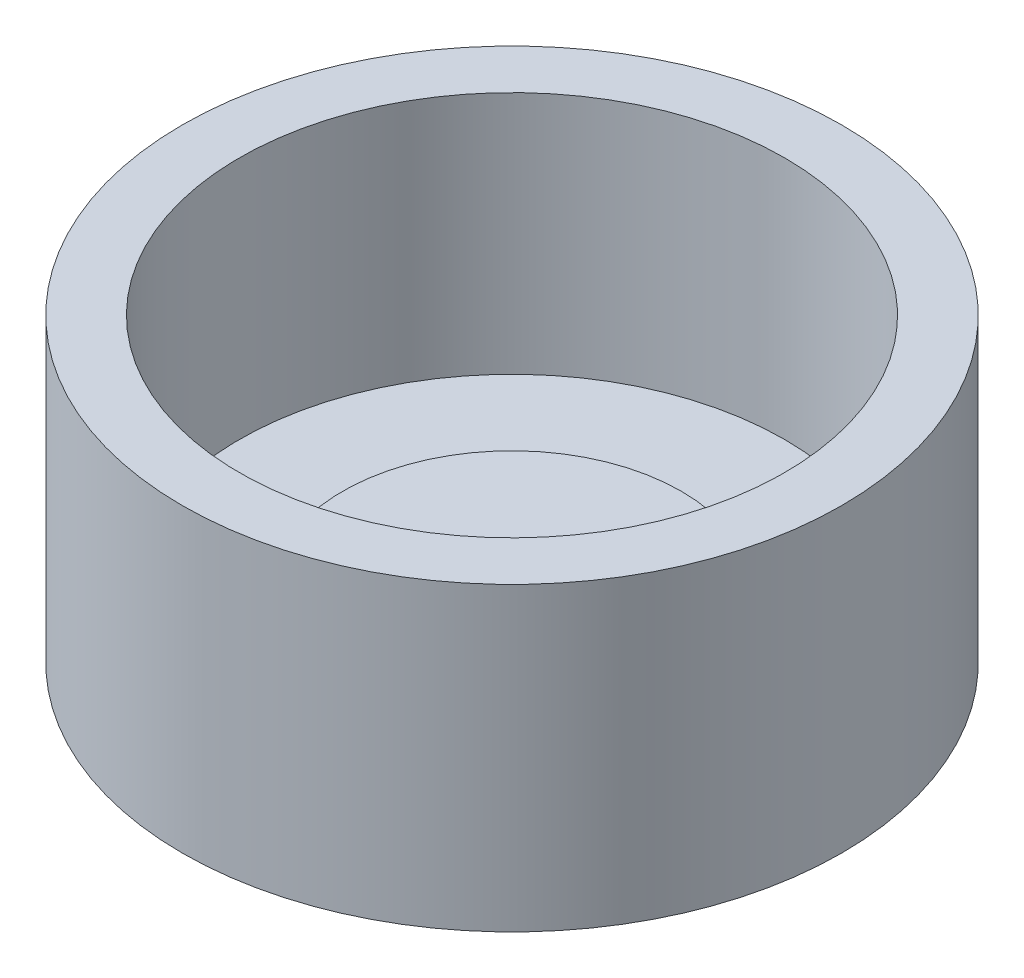
ISO-10303-21;
HEADER;
FILE_DESCRIPTION(('STEP AP214'),'2;1');
FILE_NAME('part.step','',(''),(''),'','','');
FILE_SCHEMA(('AUTOMOTIVE_DESIGN { 1 0 10303 214 1 1 1 1 }'));
ENDSEC;
DATA;
#1=APPLICATION_CONTEXT('core data for automotive mechanical design processes');
#2=APPLICATION_PROTOCOL_DEFINITION('international standard','automotive_design',2000,#1);
#3=PRODUCT_CONTEXT('',#1,'mechanical');
#4=PRODUCT('Part','Part','',(#3));
#5=PRODUCT_RELATED_PRODUCT_CATEGORY('part','',(#4));
#6=PRODUCT_DEFINITION_FORMATION('','',#4);
#7=PRODUCT_DEFINITION_CONTEXT('part definition',#1,'design');
#8=PRODUCT_DEFINITION('design','',#6,#7);
#9=PRODUCT_DEFINITION_SHAPE('','',#8);
#10=(LENGTH_UNIT() NAMED_UNIT(*) SI_UNIT(.MILLI.,.METRE.));
#11=(NAMED_UNIT(*) PLANE_ANGLE_UNIT() SI_UNIT($,.RADIAN.));
#12=(NAMED_UNIT(*) SI_UNIT($,.STERADIAN.) SOLID_ANGLE_UNIT());
#13=UNCERTAINTY_MEASURE_WITH_UNIT(LENGTH_MEASURE(1.E-05),#10,'distance_accuracy_value','');
#14=(GEOMETRIC_REPRESENTATION_CONTEXT(3) GLOBAL_UNCERTAINTY_ASSIGNED_CONTEXT((#13)) GLOBAL_UNIT_ASSIGNED_CONTEXT((#10,
#11,#12)) REPRESENTATION_CONTEXT('',''));
#15=CARTESIAN_POINT('',(0.,0.,0.));
#16=DIRECTION('',(0.,0.,1.));
#17=DIRECTION('',(1.,0.,0.));
#18=AXIS2_PLACEMENT_3D('',#15,#16,#17);
#19=CARTESIAN_POINT('',(25.,0.,0.));
#20=DIRECTION('',(0.,1.,0.));
#21=DIRECTION('',(0.,0.,1.));
#22=AXIS2_PLACEMENT_3D('',#19,#20,#21);
#23=PLANE('',#22);
#24=CARTESIAN_POINT('',(0.,0.,0.));
#25=DIRECTION('',(0.,-1.,0.));
#26=DIRECTION('',(0.,0.,-1.));
#27=AXIS2_PLACEMENT_3D('',#24,#25,#26);
#28=CIRCLE('',#27,25.);
#29=CARTESIAN_POINT('',(0.,0.,-25.));
#30=VERTEX_POINT('',#29);
#31=EDGE_CURVE('E10',#30,#30,#28,.T.);
#32=ORIENTED_EDGE('',*,*,#31,.F.);
#33=EDGE_LOOP('',(#32));
#34=FACE_BOUND('',#33,.T.);
#35=ADVANCED_FACE('F372',(#34),#23,.T.);
#36=CARTESIAN_POINT('',(0.,0.,0.));
#37=DIRECTION('',(0.,-1.,0.));
#38=DIRECTION('',(0.,0.,-1.));
#39=AXIS2_PLACEMENT_3D('',#36,#37,#38);
#40=CYLINDRICAL_SURFACE('',#39,25.);
#41=ORIENTED_EDGE('',*,*,#31,.T.);
#42=EDGE_LOOP('',(#41));
#43=FACE_BOUND('',#42,.T.);
#44=CARTESIAN_POINT('',(0.,-1.,0.));
#45=DIRECTION('',(0.,-1.,0.));
#46=DIRECTION('',(0.,0.,-1.));
#47=AXIS2_PLACEMENT_3D('',#44,#45,#46);
#48=CIRCLE('',#47,25.);
#49=CARTESIAN_POINT('',(0.,-1.,-25.));
#50=VERTEX_POINT('',#49);
#51=EDGE_CURVE('E378',#50,#50,#48,.T.);
#52=ORIENTED_EDGE('',*,*,#51,.F.);
#53=EDGE_LOOP('',(#52));
#54=FACE_BOUND('',#53,.T.);
#55=ADVANCED_FACE('F414',(#43,#54),#40,.T.);
#56=CARTESIAN_POINT('',(40.2380952380952,-0.999999999999999,0.));
#57=DIRECTION('',(0.,1.,0.));
#58=DIRECTION('',(0.,0.,1.));
#59=AXIS2_PLACEMENT_3D('',#56,#57,#58);
#60=PLANE('',#59);
#61=ORIENTED_EDGE('',*,*,#51,.T.);
#62=EDGE_LOOP('',(#61));
#63=FACE_BOUND('',#62,.T.);
#64=CARTESIAN_POINT('',(0.,-0.999999999999998,0.));
#65=DIRECTION('',(0.,-1.,0.));
#66=DIRECTION('',(0.,0.,-1.));
#67=AXIS2_PLACEMENT_3D('',#64,#65,#66);
#68=CIRCLE('',#67,40.2380952380952);
#69=CARTESIAN_POINT('',(0.,-0.999999999999998,-40.2380952380952));
#70=VERTEX_POINT('',#69);
#71=EDGE_CURVE('E382',#70,#70,#68,.T.);
#72=ORIENTED_EDGE('',*,*,#71,.F.);
#73=EDGE_LOOP('',(#72));
#74=FACE_BOUND('',#73,.T.);
#75=ADVANCED_FACE('F419',(#63,#74),#60,.T.);
#76=CARTESIAN_POINT('',(0.,0.,0.));
#77=DIRECTION('',(0.,-1.,0.));
#78=DIRECTION('',(0.,0.,-1.));
#79=AXIS2_PLACEMENT_3D('',#76,#77,#78);
#80=CYLINDRICAL_SURFACE('',#79,40.2380952380952);
#81=ORIENTED_EDGE('',*,*,#71,.T.);
#82=EDGE_LOOP('',(#81));
#83=FACE_BOUND('',#82,.T.);
#84=CARTESIAN_POINT('',(0.,35.,0.));
#85=DIRECTION('',(0.,-1.,0.));
#86=DIRECTION('',(0.,0.,-1.));
#87=AXIS2_PLACEMENT_3D('',#84,#85,#86);
#88=CIRCLE('',#87,40.2380952380952);
#89=CARTESIAN_POINT('',(0.,35.,-40.2380952380952));
#90=VERTEX_POINT('',#89);
#91=EDGE_CURVE('E386',#90,#90,#88,.T.);
#92=ORIENTED_EDGE('',*,*,#91,.F.);
#93=EDGE_LOOP('',(#92));
#94=FACE_BOUND('',#93,.T.);
#95=ADVANCED_FACE('F410',(#83,#94),#80,.F.);
#96=CARTESIAN_POINT('',(48.6576233793687,35.,0.));
#97=DIRECTION('',(0.,1.,0.));
#98=DIRECTION('',(0.,0.,1.));
#99=AXIS2_PLACEMENT_3D('',#96,#97,#98);
#100=PLANE('',#99);
#101=ORIENTED_EDGE('',*,*,#91,.T.);
#102=EDGE_LOOP('',(#101));
#103=FACE_BOUND('',#102,.T.);
#104=CARTESIAN_POINT('',(0.,35.,0.));
#105=DIRECTION('',(0.,-1.,0.));
#106=DIRECTION('',(0.,0.,-1.));
#107=AXIS2_PLACEMENT_3D('',#104,#105,#106);
#108=CIRCLE('',#107,48.6576233793687);
#109=CARTESIAN_POINT('',(0.,35.,-48.6576233793687));
#110=VERTEX_POINT('',#109);
#111=EDGE_CURVE('E391',#110,#110,#108,.T.);
#112=ORIENTED_EDGE('',*,*,#111,.F.);
#113=EDGE_LOOP('',(#112));
#114=FACE_BOUND('',#113,.T.);
#115=ADVANCED_FACE('F402',(#103,#114),#100,.T.);
#116=CARTESIAN_POINT('',(0.,0.,0.));
#117=DIRECTION('',(0.,-1.,0.));
#118=DIRECTION('',(0.,0.,-1.));
#119=AXIS2_PLACEMENT_3D('',#116,#117,#118);
#120=CYLINDRICAL_SURFACE('',#119,48.6576233793687);
#121=ORIENTED_EDGE('',*,*,#111,.T.);
#122=EDGE_LOOP('',(#121));
#123=FACE_BOUND('',#122,.T.);
#124=CARTESIAN_POINT('',(0.,-9.41952814127348,0.));
#125=DIRECTION('',(0.,-1.,0.));
#126=DIRECTION('',(0.,0.,-1.));
#127=AXIS2_PLACEMENT_3D('',#124,#125,#126);
#128=CIRCLE('',#127,48.6576233793687);
#129=CARTESIAN_POINT('',(0.,-9.41952814127348,-48.6576233793687));
#130=VERTEX_POINT('',#129);
#131=EDGE_CURVE('E394',#130,#130,#128,.T.);
#132=ORIENTED_EDGE('',*,*,#131,.F.);
#133=EDGE_LOOP('',(#132));
#134=FACE_BOUND('',#133,.T.);
#135=ADVANCED_FACE('F400',(#123,#134),#120,.T.);
#136=CARTESIAN_POINT('',(0.,-9.41952814127348,0.));
#137=DIRECTION('',(0.,-1.,0.));
#138=DIRECTION('',(0.,0.,-1.));
#139=AXIS2_PLACEMENT_3D('',#136,#137,#138);
#140=PLANE('',#139);
#141=ORIENTED_EDGE('',*,*,#131,.T.);
#142=EDGE_LOOP('',(#141));
#143=FACE_BOUND('',#142,.T.);
#144=ADVANCED_FACE('F398',(#143),#140,.T.);
#145=CLOSED_SHELL('',(#35,#55,#75,#95,#115,#135,#144));
#146=MANIFOLD_SOLID_BREP('B2',#145);
#147=ADVANCED_BREP_SHAPE_REPRESENTATION('',(#18,#146),#14);
#148=SHAPE_DEFINITION_REPRESENTATION(#9,#147);
ENDSEC;
END-ISO-10303-21;
